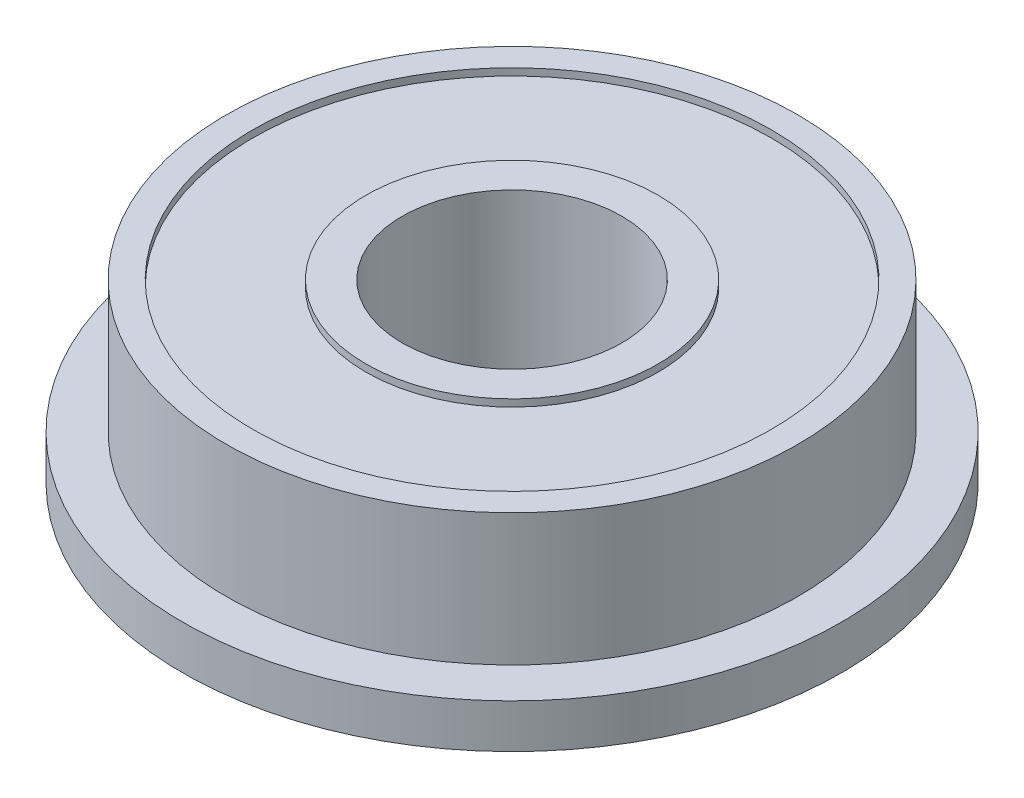
ISO-10303-21;
HEADER;
FILE_DESCRIPTION(('STEP AP214'),'2;1');
FILE_NAME('part.step','',(''),(''),'','','');
FILE_SCHEMA(('AUTOMOTIVE_DESIGN { 1 0 10303 214 1 1 1 1 }'));
ENDSEC;
DATA;
#1=APPLICATION_CONTEXT('core data for automotive mechanical design processes');
#2=APPLICATION_PROTOCOL_DEFINITION('international standard','automotive_design',2000,#1);
#3=PRODUCT_CONTEXT('',#1,'mechanical');
#4=PRODUCT('Part','Part','',(#3));
#5=PRODUCT_RELATED_PRODUCT_CATEGORY('part','',(#4));
#6=PRODUCT_DEFINITION_FORMATION('','',#4);
#7=PRODUCT_DEFINITION_CONTEXT('part definition',#1,'design');
#8=PRODUCT_DEFINITION('design','',#6,#7);
#9=PRODUCT_DEFINITION_SHAPE('','',#8);
#10=(LENGTH_UNIT() NAMED_UNIT(*) SI_UNIT(.MILLI.,.METRE.));
#11=(NAMED_UNIT(*) PLANE_ANGLE_UNIT() SI_UNIT($,.RADIAN.));
#12=(NAMED_UNIT(*) SI_UNIT($,.STERADIAN.) SOLID_ANGLE_UNIT());
#13=UNCERTAINTY_MEASURE_WITH_UNIT(LENGTH_MEASURE(1.E-05),#10,'distance_accuracy_value','');
#14=(GEOMETRIC_REPRESENTATION_CONTEXT(3) GLOBAL_UNCERTAINTY_ASSIGNED_CONTEXT((#13)) GLOBAL_UNIT_ASSIGNED_CONTEXT((#10,
#11,#12)) REPRESENTATION_CONTEXT('',''));
#15=CARTESIAN_POINT('',(0.,0.,0.));
#16=DIRECTION('',(0.,0.,1.));
#17=DIRECTION('',(1.,0.,0.));
#18=AXIS2_PLACEMENT_3D('',#15,#16,#17);
#19=CARTESIAN_POINT('',(0.,0.,0.));
#20=DIRECTION('',(0.,-1.,0.));
#21=DIRECTION('',(0.,0.,-1.));
#22=AXIS2_PLACEMENT_3D('',#19,#20,#21);
#23=CYLINDRICAL_SURFACE('',#22,2.5);
#24=CARTESIAN_POINT('',(0.,0.,0.));
#25=DIRECTION('',(0.,-1.,0.));
#26=DIRECTION('',(0.,0.,-1.));
#27=AXIS2_PLACEMENT_3D('',#24,#25,#26);
#28=CIRCLE('',#27,2.5);
#29=CARTESIAN_POINT('',(0.,0.,-2.5));
#30=VERTEX_POINT('',#29);
#31=EDGE_CURVE('E10',#30,#30,#28,.T.);
#32=ORIENTED_EDGE('',*,*,#31,.T.);
#33=EDGE_LOOP('',(#32));
#34=FACE_BOUND('',#33,.T.);
#35=CARTESIAN_POINT('',(0.,4.,0.));
#36=DIRECTION('',(0.,-1.,0.));
#37=DIRECTION('',(0.,0.,-1.));
#38=AXIS2_PLACEMENT_3D('',#35,#36,#37);
#39=CIRCLE('',#38,2.5);
#40=CARTESIAN_POINT('',(0.,4.,-2.5));
#41=VERTEX_POINT('',#40);
#42=EDGE_CURVE('E102',#41,#41,#39,.T.);
#43=ORIENTED_EDGE('',*,*,#42,.F.);
#44=EDGE_LOOP('',(#43));
#45=FACE_BOUND('',#44,.T.);
#46=ADVANCED_FACE('F43',(#34,#45),#23,.F.);
#47=CARTESIAN_POINT('',(2.5,0.,0.));
#48=DIRECTION('',(0.,-1.,0.));
#49=DIRECTION('',(0.,0.,-1.));
#50=AXIS2_PLACEMENT_3D('',#47,#48,#49);
#51=PLANE('',#50);
#52=CARTESIAN_POINT('',(0.,0.,0.));
#53=DIRECTION('',(0.,-1.,0.));
#54=DIRECTION('',(0.,0.,-1.));
#55=AXIS2_PLACEMENT_3D('',#52,#53,#54);
#56=CIRCLE('',#55,3.3262193262177);
#57=CARTESIAN_POINT('',(0.,0.,-3.3262193262177));
#58=VERTEX_POINT('',#57);
#59=EDGE_CURVE('E50',#58,#58,#56,.T.);
#60=ORIENTED_EDGE('',*,*,#59,.T.);
#61=EDGE_LOOP('',(#60));
#62=FACE_BOUND('',#61,.T.);
#63=ORIENTED_EDGE('',*,*,#31,.F.);
#64=EDGE_LOOP('',(#63));
#65=FACE_BOUND('',#64,.T.);
#66=ADVANCED_FACE('F112',(#62,#65),#51,.T.);
#67=CARTESIAN_POINT('',(0.,0.,0.));
#68=DIRECTION('',(0.,-1.,0.));
#69=DIRECTION('',(0.,0.,-1.));
#70=AXIS2_PLACEMENT_3D('',#67,#68,#69);
#71=CYLINDRICAL_SURFACE('',#70,3.3262193262177);
#72=CARTESIAN_POINT('',(0.,0.162212442854051,0.));
#73=DIRECTION('',(0.,-1.,0.));
#74=DIRECTION('',(0.,0.,-1.));
#75=AXIS2_PLACEMENT_3D('',#72,#73,#74);
#76=CIRCLE('',#75,3.3262193262177);
#77=CARTESIAN_POINT('',(0.,0.162212442854051,-3.3262193262177));
#78=VERTEX_POINT('',#77);
#79=EDGE_CURVE('E58',#78,#78,#76,.T.);
#80=ORIENTED_EDGE('',*,*,#79,.T.);
#81=EDGE_LOOP('',(#80));
#82=FACE_BOUND('',#81,.T.);
#83=ORIENTED_EDGE('',*,*,#59,.F.);
#84=EDGE_LOOP('',(#83));
#85=FACE_BOUND('',#84,.T.);
#86=ADVANCED_FACE('F117',(#82,#85),#71,.T.);
#87=CARTESIAN_POINT('',(3.3262193262177,0.162212442854051,0.));
#88=DIRECTION('',(0.,-1.,0.));
#89=DIRECTION('',(0.,0.,-1.));
#90=AXIS2_PLACEMENT_3D('',#87,#88,#89);
#91=PLANE('',#90);
#92=CARTESIAN_POINT('',(0.,0.162212442854051,0.));
#93=DIRECTION('',(0.,-1.,0.));
#94=DIRECTION('',(0.,0.,-1.));
#95=AXIS2_PLACEMENT_3D('',#92,#93,#94);
#96=CIRCLE('',#95,5.90357272206126);
#97=CARTESIAN_POINT('',(0.,0.162212442854051,-5.90357272206126));
#98=VERTEX_POINT('',#97);
#99=EDGE_CURVE('E65',#98,#98,#96,.T.);
#100=ORIENTED_EDGE('',*,*,#99,.T.);
#101=EDGE_LOOP('',(#100));
#102=FACE_BOUND('',#101,.T.);
#103=ORIENTED_EDGE('',*,*,#79,.F.);
#104=EDGE_LOOP('',(#103));
#105=FACE_BOUND('',#104,.T.);
#106=ADVANCED_FACE('F123',(#102,#105),#91,.T.);
#107=CARTESIAN_POINT('',(0.,0.,0.));
#108=DIRECTION('',(0.,-1.,0.));
#109=DIRECTION('',(0.,0.,-1.));
#110=AXIS2_PLACEMENT_3D('',#107,#108,#109);
#111=CYLINDRICAL_SURFACE('',#110,5.90357272206126);
#112=CARTESIAN_POINT('',(0.,0.,0.));
#113=DIRECTION('',(0.,-1.,0.));
#114=DIRECTION('',(0.,0.,-1.));
#115=AXIS2_PLACEMENT_3D('',#112,#113,#114);
#116=CIRCLE('',#115,5.90357272206126);
#117=CARTESIAN_POINT('',(0.,0.,-5.90357272206126));
#118=VERTEX_POINT('',#117);
#119=EDGE_CURVE('E70',#118,#118,#116,.T.);
#120=ORIENTED_EDGE('',*,*,#119,.T.);
#121=EDGE_LOOP('',(#120));
#122=FACE_BOUND('',#121,.T.);
#123=ORIENTED_EDGE('',*,*,#99,.F.);
#124=EDGE_LOOP('',(#123));
#125=FACE_BOUND('',#124,.T.);
#126=ADVANCED_FACE('F130',(#122,#125),#111,.F.);
#127=CARTESIAN_POINT('',(5.90357272206126,0.,0.));
#128=DIRECTION('',(0.,-1.,0.));
#129=DIRECTION('',(0.,0.,-1.));
#130=AXIS2_PLACEMENT_3D('',#127,#128,#129);
#131=PLANE('',#130);
#132=CARTESIAN_POINT('',(0.,0.,0.));
#133=DIRECTION('',(0.,-1.,0.));
#134=DIRECTION('',(0.,0.,-1.));
#135=AXIS2_PLACEMENT_3D('',#132,#133,#134);
#136=CIRCLE('',#135,7.5);
#137=CARTESIAN_POINT('',(0.,0.,-7.5));
#138=VERTEX_POINT('',#137);
#139=EDGE_CURVE('E74',#138,#138,#136,.T.);
#140=ORIENTED_EDGE('',*,*,#139,.T.);
#141=EDGE_LOOP('',(#140));
#142=FACE_BOUND('',#141,.T.);
#143=ORIENTED_EDGE('',*,*,#119,.F.);
#144=EDGE_LOOP('',(#143));
#145=FACE_BOUND('',#144,.T.);
#146=ADVANCED_FACE('F134',(#142,#145),#131,.T.);
#147=CARTESIAN_POINT('',(0.,0.,0.));
#148=DIRECTION('',(0.,-1.,0.));
#149=DIRECTION('',(0.,0.,-1.));
#150=AXIS2_PLACEMENT_3D('',#147,#148,#149);
#151=CYLINDRICAL_SURFACE('',#150,7.5);
#152=CARTESIAN_POINT('',(0.,1.,0.));
#153=DIRECTION('',(0.,-1.,0.));
#154=DIRECTION('',(0.,0.,-1.));
#155=AXIS2_PLACEMENT_3D('',#152,#153,#154);
#156=CIRCLE('',#155,7.5);
#157=CARTESIAN_POINT('',(0.,1.,-7.5));
#158=VERTEX_POINT('',#157);
#159=EDGE_CURVE('E78',#158,#158,#156,.T.);
#160=ORIENTED_EDGE('',*,*,#159,.T.);
#161=EDGE_LOOP('',(#160));
#162=FACE_BOUND('',#161,.T.);
#163=ORIENTED_EDGE('',*,*,#139,.F.);
#164=EDGE_LOOP('',(#163));
#165=FACE_BOUND('',#164,.T.);
#166=ADVANCED_FACE('F137',(#162,#165),#151,.T.);
#167=CARTESIAN_POINT('',(7.5,1.,0.));
#168=DIRECTION('',(0.,1.,0.));
#169=DIRECTION('',(0.,0.,1.));
#170=AXIS2_PLACEMENT_3D('',#167,#168,#169);
#171=PLANE('',#170);
#172=CARTESIAN_POINT('',(0.,1.,0.));
#173=DIRECTION('',(0.,-1.,0.));
#174=DIRECTION('',(0.,0.,-1.));
#175=AXIS2_PLACEMENT_3D('',#172,#173,#174);
#176=CIRCLE('',#175,6.5);
#177=CARTESIAN_POINT('',(0.,1.,-6.5));
#178=VERTEX_POINT('',#177);
#179=EDGE_CURVE('E81',#178,#178,#176,.T.);
#180=ORIENTED_EDGE('',*,*,#179,.T.);
#181=EDGE_LOOP('',(#180));
#182=FACE_BOUND('',#181,.T.);
#183=ORIENTED_EDGE('',*,*,#159,.F.);
#184=EDGE_LOOP('',(#183));
#185=FACE_BOUND('',#184,.T.);
#186=ADVANCED_FACE('F141',(#182,#185),#171,.T.);
#187=CARTESIAN_POINT('',(0.,0.,0.));
#188=DIRECTION('',(0.,-1.,0.));
#189=DIRECTION('',(0.,0.,-1.));
#190=AXIS2_PLACEMENT_3D('',#187,#188,#189);
#191=CYLINDRICAL_SURFACE('',#190,6.5);
#192=CARTESIAN_POINT('',(0.,4.,0.));
#193=DIRECTION('',(0.,-1.,0.));
#194=DIRECTION('',(0.,0.,-1.));
#195=AXIS2_PLACEMENT_3D('',#192,#193,#194);
#196=CIRCLE('',#195,6.5);
#197=CARTESIAN_POINT('',(0.,4.,-6.5));
#198=VERTEX_POINT('',#197);
#199=EDGE_CURVE('E84',#198,#198,#196,.T.);
#200=ORIENTED_EDGE('',*,*,#199,.T.);
#201=EDGE_LOOP('',(#200));
#202=FACE_BOUND('',#201,.T.);
#203=ORIENTED_EDGE('',*,*,#179,.F.);
#204=EDGE_LOOP('',(#203));
#205=FACE_BOUND('',#204,.T.);
#206=ADVANCED_FACE('F144',(#202,#205),#191,.T.);
#207=CARTESIAN_POINT('',(6.5,4.,0.));
#208=DIRECTION('',(0.,1.,0.));
#209=DIRECTION('',(0.,0.,1.));
#210=AXIS2_PLACEMENT_3D('',#207,#208,#209);
#211=PLANE('',#210);
#212=CARTESIAN_POINT('',(0.,4.,0.));
#213=DIRECTION('',(0.,-1.,0.));
#214=DIRECTION('',(0.,0.,-1.));
#215=AXIS2_PLACEMENT_3D('',#212,#213,#214);
#216=CIRCLE('',#215,5.90357272206126);
#217=CARTESIAN_POINT('',(0.,4.,-5.90357272206126));
#218=VERTEX_POINT('',#217);
#219=EDGE_CURVE('E88',#218,#218,#216,.T.);
#220=ORIENTED_EDGE('',*,*,#219,.T.);
#221=EDGE_LOOP('',(#220));
#222=FACE_BOUND('',#221,.T.);
#223=ORIENTED_EDGE('',*,*,#199,.F.);
#224=EDGE_LOOP('',(#223));
#225=FACE_BOUND('',#224,.T.);
#226=ADVANCED_FACE('F147',(#222,#225),#211,.T.);
#227=CARTESIAN_POINT('',(0.,0.,0.));
#228=DIRECTION('',(0.,-1.,0.));
#229=DIRECTION('',(0.,0.,-1.));
#230=AXIS2_PLACEMENT_3D('',#227,#228,#229);
#231=CYLINDRICAL_SURFACE('',#230,5.90357272206126);
#232=CARTESIAN_POINT('',(0.,3.83778755714595,0.));
#233=DIRECTION('',(0.,-1.,0.));
#234=DIRECTION('',(0.,0.,-1.));
#235=AXIS2_PLACEMENT_3D('',#232,#233,#234);
#236=CIRCLE('',#235,5.90357272206126);
#237=CARTESIAN_POINT('',(0.,3.83778755714595,-5.90357272206126));
#238=VERTEX_POINT('',#237);
#239=EDGE_CURVE('E91',#238,#238,#236,.T.);
#240=ORIENTED_EDGE('',*,*,#239,.T.);
#241=EDGE_LOOP('',(#240));
#242=FACE_BOUND('',#241,.T.);
#243=ORIENTED_EDGE('',*,*,#219,.F.);
#244=EDGE_LOOP('',(#243));
#245=FACE_BOUND('',#244,.T.);
#246=ADVANCED_FACE('F151',(#242,#245),#231,.F.);
#247=CARTESIAN_POINT('',(3.3262193262177,3.83778755714595,0.));
#248=DIRECTION('',(0.,1.,0.));
#249=DIRECTION('',(0.,0.,1.));
#250=AXIS2_PLACEMENT_3D('',#247,#248,#249);
#251=PLANE('',#250);
#252=CARTESIAN_POINT('',(0.,3.83778755714595,0.));
#253=DIRECTION('',(0.,-1.,0.));
#254=DIRECTION('',(0.,0.,-1.));
#255=AXIS2_PLACEMENT_3D('',#252,#253,#254);
#256=CIRCLE('',#255,3.3262193262177);
#257=CARTESIAN_POINT('',(0.,3.83778755714595,-3.3262193262177));
#258=VERTEX_POINT('',#257);
#259=EDGE_CURVE('E95',#258,#258,#256,.T.);
#260=ORIENTED_EDGE('',*,*,#259,.T.);
#261=EDGE_LOOP('',(#260));
#262=FACE_BOUND('',#261,.T.);
#263=ORIENTED_EDGE('',*,*,#239,.F.);
#264=EDGE_LOOP('',(#263));
#265=FACE_BOUND('',#264,.T.);
#266=ADVANCED_FACE('F155',(#262,#265),#251,.T.);
#267=CARTESIAN_POINT('',(0.,0.,0.));
#268=DIRECTION('',(0.,-1.,0.));
#269=DIRECTION('',(0.,0.,-1.));
#270=AXIS2_PLACEMENT_3D('',#267,#268,#269);
#271=CYLINDRICAL_SURFACE('',#270,3.3262193262177);
#272=CARTESIAN_POINT('',(0.,4.,0.));
#273=DIRECTION('',(0.,-1.,0.));
#274=DIRECTION('',(0.,0.,-1.));
#275=AXIS2_PLACEMENT_3D('',#272,#273,#274);
#276=CIRCLE('',#275,3.3262193262177);
#277=CARTESIAN_POINT('',(0.,4.,-3.3262193262177));
#278=VERTEX_POINT('',#277);
#279=EDGE_CURVE('E99',#278,#278,#276,.T.);
#280=ORIENTED_EDGE('',*,*,#279,.T.);
#281=EDGE_LOOP('',(#280));
#282=FACE_BOUND('',#281,.T.);
#283=ORIENTED_EDGE('',*,*,#259,.F.);
#284=EDGE_LOOP('',(#283));
#285=FACE_BOUND('',#284,.T.);
#286=ADVANCED_FACE('F159',(#282,#285),#271,.T.);
#287=CARTESIAN_POINT('',(3.3262193262177,4.,0.));
#288=DIRECTION('',(0.,1.,0.));
#289=DIRECTION('',(0.,0.,1.));
#290=AXIS2_PLACEMENT_3D('',#287,#288,#289);
#291=PLANE('',#290);
#292=ORIENTED_EDGE('',*,*,#42,.T.);
#293=EDGE_LOOP('',(#292));
#294=FACE_BOUND('',#293,.T.);
#295=ORIENTED_EDGE('',*,*,#279,.F.);
#296=EDGE_LOOP('',(#295));
#297=FACE_BOUND('',#296,.T.);
#298=ADVANCED_FACE('F108',(#294,#297),#291,.T.);
#299=CLOSED_SHELL('',(#46,#66,#86,#106,#126,#146,#166,#186,#206,#226,#246,#266,#286,#298));
#300=MANIFOLD_SOLID_BREP('B2',#299);
#301=ADVANCED_BREP_SHAPE_REPRESENTATION('',(#18,#300),#14);
#302=SHAPE_DEFINITION_REPRESENTATION(#9,#301);
ENDSEC;
END-ISO-10303-21;
